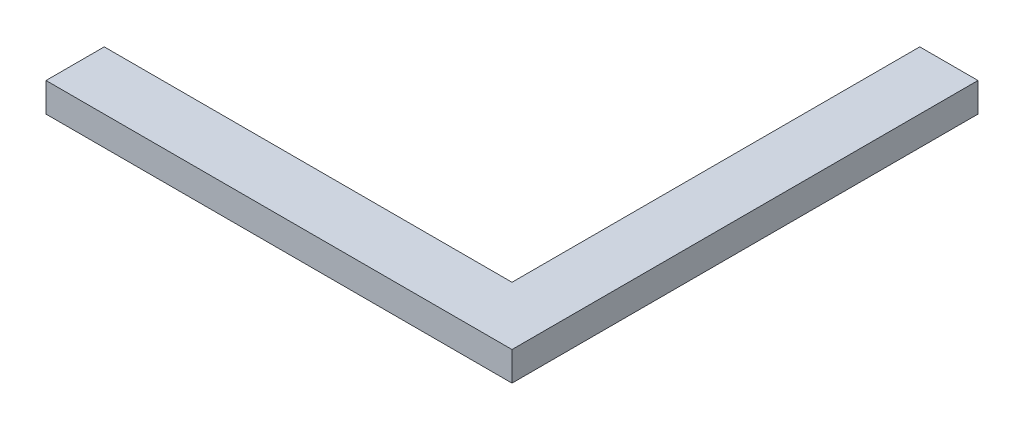
ISO-10303-21;
HEADER;
FILE_DESCRIPTION(('STEP AP214'),'2;1');
FILE_NAME('part.step','',(''),(''),'','','');
FILE_SCHEMA(('AUTOMOTIVE_DESIGN { 1 0 10303 214 1 1 1 1 }'));
ENDSEC;
DATA;
#1=APPLICATION_CONTEXT('core data for automotive mechanical design processes');
#2=APPLICATION_PROTOCOL_DEFINITION('international standard','automotive_design',2000,#1);
#3=PRODUCT_CONTEXT('',#1,'mechanical');
#4=PRODUCT('Part','Part','',(#3));
#5=PRODUCT_RELATED_PRODUCT_CATEGORY('part','',(#4));
#6=PRODUCT_DEFINITION_FORMATION('','',#4);
#7=PRODUCT_DEFINITION_CONTEXT('part definition',#1,'design');
#8=PRODUCT_DEFINITION('design','',#6,#7);
#9=PRODUCT_DEFINITION_SHAPE('','',#8);
#10=(LENGTH_UNIT() NAMED_UNIT(*) SI_UNIT(.MILLI.,.METRE.));
#11=(NAMED_UNIT(*) PLANE_ANGLE_UNIT() SI_UNIT($,.RADIAN.));
#12=(NAMED_UNIT(*) SI_UNIT($,.STERADIAN.) SOLID_ANGLE_UNIT());
#13=UNCERTAINTY_MEASURE_WITH_UNIT(LENGTH_MEASURE(1.E-05),#10,'distance_accuracy_value','');
#14=(GEOMETRIC_REPRESENTATION_CONTEXT(3) GLOBAL_UNCERTAINTY_ASSIGNED_CONTEXT((#13)) GLOBAL_UNIT_ASSIGNED_CONTEXT((#10,
#11,#12)) REPRESENTATION_CONTEXT('',''));
#15=CARTESIAN_POINT('',(0.,0.,0.));
#16=DIRECTION('',(0.,0.,1.));
#17=DIRECTION('',(1.,0.,0.));
#18=AXIS2_PLACEMENT_3D('',#15,#16,#17);
#19=CARTESIAN_POINT('',(80.,10.,80.));
#20=DIRECTION('',(-1.,0.,0.));
#21=DIRECTION('',(0.,0.,1.));
#22=AXIS2_PLACEMENT_3D('',#19,#20,#21);
#23=PLANE('',#22);
#24=DIRECTION('',(0.,0.,-1.));
#25=VECTOR('',#24,1.);
#26=CARTESIAN_POINT('',(80.,0.,80.));
#27=LINE('',#26,#25);
#28=CARTESIAN_POINT('',(80.,0.,80.));
#29=VERTEX_POINT('',#28);
#30=CARTESIAN_POINT('',(80.,0.,-80.));
#31=VERTEX_POINT('',#30);
#32=EDGE_CURVE('E116',#29,#31,#27,.T.);
#33=ORIENTED_EDGE('',*,*,#32,.T.);
#34=DIRECTION('',(0.,-1.,0.));
#35=VECTOR('',#34,1.);
#36=CARTESIAN_POINT('',(80.,10.,-80.));
#37=LINE('',#36,#35);
#38=CARTESIAN_POINT('',(80.,10.,-80.));
#39=VERTEX_POINT('',#38);
#40=EDGE_CURVE('E11',#39,#31,#37,.T.);
#41=ORIENTED_EDGE('',*,*,#40,.F.);
#42=DIRECTION('',(0.,0.,-1.));
#43=VECTOR('',#42,1.);
#44=CARTESIAN_POINT('',(80.,10.,80.));
#45=LINE('',#44,#43);
#46=CARTESIAN_POINT('',(80.,10.,80.));
#47=VERTEX_POINT('',#46);
#48=EDGE_CURVE('E126',#47,#39,#45,.T.);
#49=ORIENTED_EDGE('',*,*,#48,.F.);
#50=DIRECTION('',(0.,-1.,0.));
#51=VECTOR('',#50,1.);
#52=CARTESIAN_POINT('',(80.,10.,80.));
#53=LINE('',#52,#51);
#54=EDGE_CURVE('E112',#47,#29,#53,.T.);
#55=ORIENTED_EDGE('',*,*,#54,.T.);
#56=EDGE_LOOP('',(#33,#41,#49,#55));
#57=FACE_BOUND('',#56,.T.);
#58=ADVANCED_FACE('F32',(#57),#23,.F.);
#59=CARTESIAN_POINT('',(80.,10.,-80.));
#60=DIRECTION('',(0.,0.,1.));
#61=DIRECTION('',(1.,0.,0.));
#62=AXIS2_PLACEMENT_3D('',#59,#60,#61);
#63=PLANE('',#62);
#64=DIRECTION('',(-1.,0.,0.));
#65=VECTOR('',#64,1.);
#66=CARTESIAN_POINT('',(80.,0.,-80.));
#67=LINE('',#66,#65);
#68=CARTESIAN_POINT('',(60.,0.,-80.));
#69=VERTEX_POINT('',#68);
#70=EDGE_CURVE('E119',#31,#69,#67,.T.);
#71=ORIENTED_EDGE('',*,*,#70,.T.);
#72=DIRECTION('',(0.,-1.,0.));
#73=VECTOR('',#72,1.);
#74=CARTESIAN_POINT('',(60.,10.,-80.));
#75=LINE('',#74,#73);
#76=CARTESIAN_POINT('',(60.,10.,-80.));
#77=VERTEX_POINT('',#76);
#78=EDGE_CURVE('E40',#77,#69,#75,.T.);
#79=ORIENTED_EDGE('',*,*,#78,.F.);
#80=DIRECTION('',(-1.,0.,0.));
#81=VECTOR('',#80,1.);
#82=CARTESIAN_POINT('',(80.,10.,-80.));
#83=LINE('',#82,#81);
#84=EDGE_CURVE('E85',#39,#77,#83,.T.);
#85=ORIENTED_EDGE('',*,*,#84,.F.);
#86=ORIENTED_EDGE('',*,*,#40,.T.);
#87=EDGE_LOOP('',(#71,#79,#85,#86));
#88=FACE_BOUND('',#87,.T.);
#89=ADVANCED_FACE('F150',(#88),#63,.F.);
#90=CARTESIAN_POINT('',(60.,10.,-80.));
#91=DIRECTION('',(1.,0.,0.));
#92=DIRECTION('',(0.,0.,-1.));
#93=AXIS2_PLACEMENT_3D('',#90,#91,#92);
#94=PLANE('',#93);
#95=DIRECTION('',(0.,0.,1.));
#96=VECTOR('',#95,1.);
#97=CARTESIAN_POINT('',(60.,0.,-80.));
#98=LINE('',#97,#96);
#99=CARTESIAN_POINT('',(60.,0.,60.));
#100=VERTEX_POINT('',#99);
#101=EDGE_CURVE('E121',#69,#100,#98,.T.);
#102=ORIENTED_EDGE('',*,*,#101,.T.);
#103=DIRECTION('',(0.,-1.,0.));
#104=VECTOR('',#103,1.);
#105=CARTESIAN_POINT('',(60.,10.,60.));
#106=LINE('',#105,#104);
#107=CARTESIAN_POINT('',(60.,10.,60.));
#108=VERTEX_POINT('',#107);
#109=EDGE_CURVE('E107',#108,#100,#106,.T.);
#110=ORIENTED_EDGE('',*,*,#109,.F.);
#111=DIRECTION('',(0.,0.,1.));
#112=VECTOR('',#111,1.);
#113=CARTESIAN_POINT('',(60.,10.,-80.));
#114=LINE('',#113,#112);
#115=EDGE_CURVE('E98',#77,#108,#114,.T.);
#116=ORIENTED_EDGE('',*,*,#115,.F.);
#117=ORIENTED_EDGE('',*,*,#78,.T.);
#118=EDGE_LOOP('',(#102,#110,#116,#117));
#119=FACE_BOUND('',#118,.T.);
#120=ADVANCED_FACE('F132',(#119),#94,.F.);
#121=CARTESIAN_POINT('',(60.,10.,60.));
#122=DIRECTION('',(0.,0.,1.));
#123=DIRECTION('',(1.,0.,0.));
#124=AXIS2_PLACEMENT_3D('',#121,#122,#123);
#125=PLANE('',#124);
#126=DIRECTION('',(-1.,0.,0.));
#127=VECTOR('',#126,1.);
#128=CARTESIAN_POINT('',(60.,0.,60.));
#129=LINE('',#128,#127);
#130=CARTESIAN_POINT('',(-80.,0.,60.));
#131=VERTEX_POINT('',#130);
#132=EDGE_CURVE('E106',#100,#131,#129,.T.);
#133=ORIENTED_EDGE('',*,*,#132,.T.);
#134=DIRECTION('',(0.,-1.,0.));
#135=VECTOR('',#134,1.);
#136=CARTESIAN_POINT('',(-80.,10.,60.));
#137=LINE('',#136,#135);
#138=CARTESIAN_POINT('',(-80.,10.,60.));
#139=VERTEX_POINT('',#138);
#140=EDGE_CURVE('E103',#139,#131,#137,.T.);
#141=ORIENTED_EDGE('',*,*,#140,.F.);
#142=DIRECTION('',(-1.,0.,0.));
#143=VECTOR('',#142,1.);
#144=CARTESIAN_POINT('',(60.,10.,60.));
#145=LINE('',#144,#143);
#146=EDGE_CURVE('E92',#108,#139,#145,.T.);
#147=ORIENTED_EDGE('',*,*,#146,.F.);
#148=ORIENTED_EDGE('',*,*,#109,.T.);
#149=EDGE_LOOP('',(#133,#141,#147,#148));
#150=FACE_BOUND('',#149,.T.);
#151=ADVANCED_FACE('F104',(#150),#125,.F.);
#152=CARTESIAN_POINT('',(-80.,10.,60.));
#153=DIRECTION('',(1.,0.,0.));
#154=DIRECTION('',(0.,0.,-1.));
#155=AXIS2_PLACEMENT_3D('',#152,#153,#154);
#156=PLANE('',#155);
#157=DIRECTION('',(0.,0.,1.));
#158=VECTOR('',#157,1.);
#159=CARTESIAN_POINT('',(-80.,0.,60.));
#160=LINE('',#159,#158);
#161=CARTESIAN_POINT('',(-80.,0.,80.));
#162=VERTEX_POINT('',#161);
#163=EDGE_CURVE('E71',#131,#162,#160,.T.);
#164=ORIENTED_EDGE('',*,*,#163,.T.);
#165=DIRECTION('',(0.,-1.,0.));
#166=VECTOR('',#165,1.);
#167=CARTESIAN_POINT('',(-80.,10.,80.));
#168=LINE('',#167,#166);
#169=CARTESIAN_POINT('',(-80.,10.,80.));
#170=VERTEX_POINT('',#169);
#171=EDGE_CURVE('E108',#170,#162,#168,.T.);
#172=ORIENTED_EDGE('',*,*,#171,.F.);
#173=DIRECTION('',(0.,0.,1.));
#174=VECTOR('',#173,1.);
#175=CARTESIAN_POINT('',(-80.,10.,60.));
#176=LINE('',#175,#174);
#177=EDGE_CURVE('E96',#139,#170,#176,.T.);
#178=ORIENTED_EDGE('',*,*,#177,.F.);
#179=ORIENTED_EDGE('',*,*,#140,.T.);
#180=EDGE_LOOP('',(#164,#172,#178,#179));
#181=FACE_BOUND('',#180,.T.);
#182=ADVANCED_FACE('F110',(#181),#156,.F.);
#183=CARTESIAN_POINT('',(-80.,10.,80.));
#184=DIRECTION('',(0.,0.,-1.));
#185=DIRECTION('',(-1.,0.,0.));
#186=AXIS2_PLACEMENT_3D('',#183,#184,#185);
#187=PLANE('',#186);
#188=DIRECTION('',(1.,0.,0.));
#189=VECTOR('',#188,1.);
#190=CARTESIAN_POINT('',(-80.,0.,80.));
#191=LINE('',#190,#189);
#192=EDGE_CURVE('E77',#162,#29,#191,.T.);
#193=ORIENTED_EDGE('',*,*,#192,.T.);
#194=ORIENTED_EDGE('',*,*,#54,.F.);
#195=DIRECTION('',(1.,0.,0.));
#196=VECTOR('',#195,1.);
#197=CARTESIAN_POINT('',(-80.,10.,80.));
#198=LINE('',#197,#196);
#199=EDGE_CURVE('E48',#170,#47,#198,.T.);
#200=ORIENTED_EDGE('',*,*,#199,.F.);
#201=ORIENTED_EDGE('',*,*,#171,.T.);
#202=EDGE_LOOP('',(#193,#194,#200,#201));
#203=FACE_BOUND('',#202,.T.);
#204=ADVANCED_FACE('F139',(#203),#187,.F.);
#205=CARTESIAN_POINT('',(0.,10.,0.));
#206=DIRECTION('',(0.,1.,0.));
#207=DIRECTION('',(0.,0.,1.));
#208=AXIS2_PLACEMENT_3D('',#205,#206,#207);
#209=PLANE('',#208);
#210=ORIENTED_EDGE('',*,*,#48,.T.);
#211=ORIENTED_EDGE('',*,*,#84,.T.);
#212=ORIENTED_EDGE('',*,*,#115,.T.);
#213=ORIENTED_EDGE('',*,*,#146,.T.);
#214=ORIENTED_EDGE('',*,*,#177,.T.);
#215=ORIENTED_EDGE('',*,*,#199,.T.);
#216=EDGE_LOOP('',(#210,#211,#212,#213,#214,#215));
#217=FACE_BOUND('',#216,.T.);
#218=ADVANCED_FACE('F94',(#217),#209,.T.);
#219=CARTESIAN_POINT('',(0.,0.,0.));
#220=DIRECTION('',(0.,1.,0.));
#221=DIRECTION('',(0.,0.,1.));
#222=AXIS2_PLACEMENT_3D('',#219,#220,#221);
#223=PLANE('',#222);
#224=ORIENTED_EDGE('',*,*,#32,.F.);
#225=ORIENTED_EDGE('',*,*,#192,.F.);
#226=ORIENTED_EDGE('',*,*,#163,.F.);
#227=ORIENTED_EDGE('',*,*,#132,.F.);
#228=ORIENTED_EDGE('',*,*,#101,.F.);
#229=ORIENTED_EDGE('',*,*,#70,.F.);
#230=EDGE_LOOP('',(#224,#225,#226,#227,#228,#229));
#231=FACE_BOUND('',#230,.T.);
#232=ADVANCED_FACE('F135',(#231),#223,.F.);
#233=CLOSED_SHELL('',(#58,#89,#120,#151,#182,#204,#218,#232));
#234=MANIFOLD_SOLID_BREP('B2',#233);
#235=ADVANCED_BREP_SHAPE_REPRESENTATION('',(#18,#234),#14);
#236=SHAPE_DEFINITION_REPRESENTATION(#9,#235);
ENDSEC;
END-ISO-10303-21;
